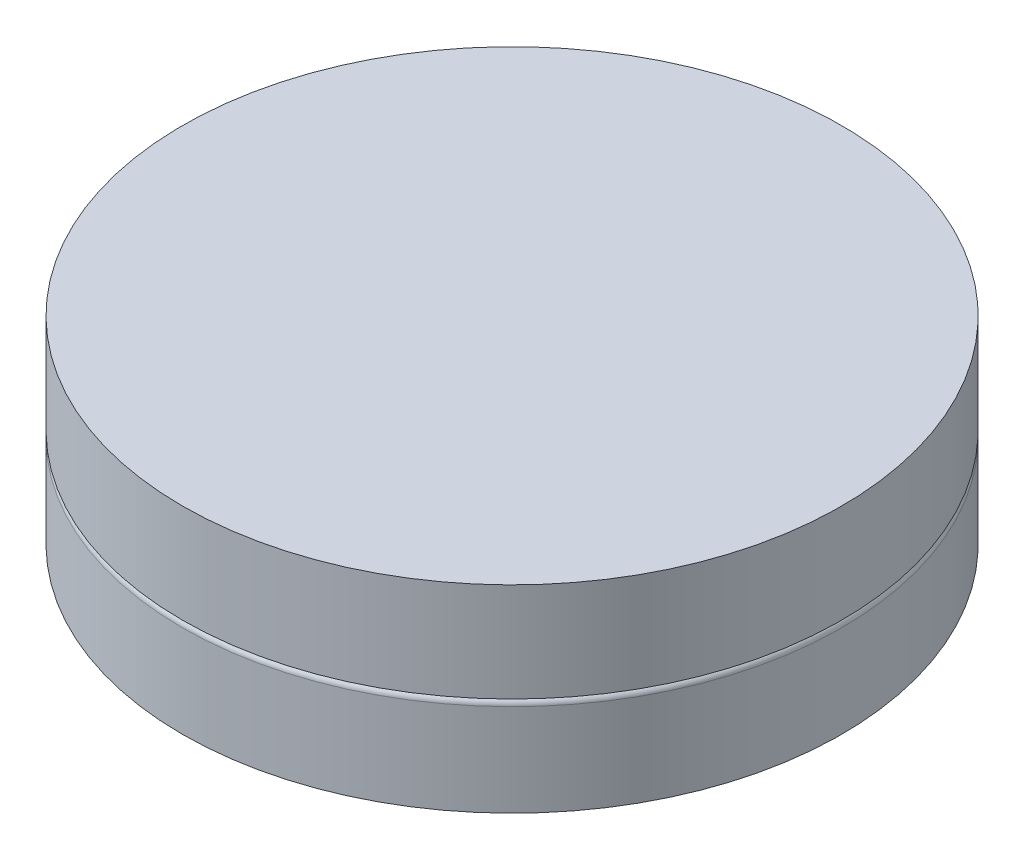
ISO-10303-21;
HEADER;
FILE_DESCRIPTION(('STEP AP214'),'2;1');
FILE_NAME('part.step','',(''),(''),'','','');
FILE_SCHEMA(('AUTOMOTIVE_DESIGN { 1 0 10303 214 1 1 1 1 }'));
ENDSEC;
DATA;
#1=APPLICATION_CONTEXT('core data for automotive mechanical design processes');
#2=APPLICATION_PROTOCOL_DEFINITION('international standard','automotive_design',2000,#1);
#3=PRODUCT_CONTEXT('',#1,'mechanical');
#4=PRODUCT('Part','Part','',(#3));
#5=PRODUCT_RELATED_PRODUCT_CATEGORY('part','',(#4));
#6=PRODUCT_DEFINITION_FORMATION('','',#4);
#7=PRODUCT_DEFINITION_CONTEXT('part definition',#1,'design');
#8=PRODUCT_DEFINITION('design','',#6,#7);
#9=PRODUCT_DEFINITION_SHAPE('','',#8);
#10=(LENGTH_UNIT() NAMED_UNIT(*) SI_UNIT(.MILLI.,.METRE.));
#11=(NAMED_UNIT(*) PLANE_ANGLE_UNIT() SI_UNIT($,.RADIAN.));
#12=(NAMED_UNIT(*) SI_UNIT($,.STERADIAN.) SOLID_ANGLE_UNIT());
#13=UNCERTAINTY_MEASURE_WITH_UNIT(LENGTH_MEASURE(1.E-05),#10,'distance_accuracy_value','');
#14=(GEOMETRIC_REPRESENTATION_CONTEXT(3) GLOBAL_UNCERTAINTY_ASSIGNED_CONTEXT((#13)) GLOBAL_UNIT_ASSIGNED_CONTEXT((#10,
#11,#12)) REPRESENTATION_CONTEXT('',''));
#15=CARTESIAN_POINT('',(0.,0.,0.));
#16=DIRECTION('',(0.,0.,1.));
#17=DIRECTION('',(1.,0.,0.));
#18=AXIS2_PLACEMENT_3D('',#15,#16,#17);
#19=CARTESIAN_POINT('',(0.,0.75,0.));
#20=DIRECTION('',(0.,-1.,0.));
#21=DIRECTION('',(0.,0.,-1.));
#22=AXIS2_PLACEMENT_3D('',#19,#20,#21);
#23=CYLINDRICAL_SURFACE('',#22,2.5);
#24=CARTESIAN_POINT('',(0.,0.7,0.));
#25=DIRECTION('',(0.,1.,0.));
#26=DIRECTION('',(0.,0.,1.));
#27=AXIS2_PLACEMENT_3D('',#24,#25,#26);
#28=CIRCLE('',#27,2.5);
#29=CARTESIAN_POINT('',(0.,0.7,2.5));
#30=VERTEX_POINT('',#29);
#31=EDGE_CURVE('E10',#30,#30,#28,.F.);
#32=ORIENTED_EDGE('',*,*,#31,.T.);
#33=EDGE_LOOP('',(#32));
#34=FACE_BOUND('',#33,.T.);
#35=CARTESIAN_POINT('',(0.,0.,0.));
#36=DIRECTION('',(0.,1.,0.));
#37=DIRECTION('',(0.,0.,1.));
#38=AXIS2_PLACEMENT_3D('',#35,#36,#37);
#39=CIRCLE('',#38,2.5);
#40=CARTESIAN_POINT('',(0.,0.,2.5));
#41=VERTEX_POINT('',#40);
#42=EDGE_CURVE('E41',#41,#41,#39,.T.);
#43=ORIENTED_EDGE('',*,*,#42,.T.);
#44=EDGE_LOOP('',(#43));
#45=FACE_BOUND('',#44,.T.);
#46=ADVANCED_FACE('F30',(#34,#45),#23,.T.);
#47=CARTESIAN_POINT('',(0.,0.,0.));
#48=DIRECTION('',(0.,1.,0.));
#49=DIRECTION('',(0.,0.,1.));
#50=AXIS2_PLACEMENT_3D('',#47,#48,#49);
#51=PLANE('',#50);
#52=ORIENTED_EDGE('',*,*,#42,.F.);
#53=EDGE_LOOP('',(#52));
#54=FACE_BOUND('',#53,.T.);
#55=ADVANCED_FACE('F70',(#54),#51,.F.);
#56=CARTESIAN_POINT('',(0.,0.7,0.));
#57=DIRECTION('',(0.,1.,0.));
#58=DIRECTION('',(0.,0.,1.));
#59=AXIS2_PLACEMENT_3D('',#56,#57,#58);
#60=TOROIDAL_SURFACE('',#59,2.45,0.05);
#61=ORIENTED_EDGE('',*,*,#31,.F.);
#62=EDGE_LOOP('',(#61));
#63=FACE_BOUND('',#62,.T.);
#64=CARTESIAN_POINT('',(0.,0.75,0.));
#65=DIRECTION('',(0.,1.,0.));
#66=DIRECTION('',(0.,0.,1.));
#67=AXIS2_PLACEMENT_3D('',#64,#65,#66);
#68=CIRCLE('',#67,2.45);
#69=CARTESIAN_POINT('',(0.,0.75,2.45));
#70=VERTEX_POINT('',#69);
#71=EDGE_CURVE('E37',#70,#70,#68,.T.);
#72=ORIENTED_EDGE('',*,*,#71,.F.);
#73=EDGE_LOOP('',(#72));
#74=FACE_BOUND('',#73,.T.);
#75=ADVANCED_FACE('F32',(#63,#74),#60,.T.);
#76=CARTESIAN_POINT('',(0.,1.5,0.));
#77=DIRECTION('',(0.,-1.,0.));
#78=DIRECTION('',(0.,0.,-1.));
#79=AXIS2_PLACEMENT_3D('',#76,#77,#78);
#80=CYLINDRICAL_SURFACE('',#79,2.5);
#81=CARTESIAN_POINT('',(0.,1.5,0.));
#82=DIRECTION('',(0.,1.,0.));
#83=DIRECTION('',(0.,0.,1.));
#84=AXIS2_PLACEMENT_3D('',#81,#82,#83);
#85=CIRCLE('',#84,2.5);
#86=CARTESIAN_POINT('',(0.,1.5,2.5));
#87=VERTEX_POINT('',#86);
#88=EDGE_CURVE('E45',#87,#87,#85,.T.);
#89=ORIENTED_EDGE('',*,*,#88,.F.);
#90=EDGE_LOOP('',(#89));
#91=FACE_BOUND('',#90,.T.);
#92=CARTESIAN_POINT('',(0.,0.75,0.));
#93=DIRECTION('',(0.,1.,0.));
#94=DIRECTION('',(0.,0.,1.));
#95=AXIS2_PLACEMENT_3D('',#92,#93,#94);
#96=CIRCLE('',#95,2.5);
#97=CARTESIAN_POINT('',(0.,0.75,2.5));
#98=VERTEX_POINT('',#97);
#99=EDGE_CURVE('E48',#98,#98,#96,.T.);
#100=ORIENTED_EDGE('',*,*,#99,.T.);
#101=EDGE_LOOP('',(#100));
#102=FACE_BOUND('',#101,.T.);
#103=ADVANCED_FACE('F56',(#91,#102),#80,.T.);
#104=CARTESIAN_POINT('',(0.,1.5,0.));
#105=DIRECTION('',(0.,1.,0.));
#106=DIRECTION('',(0.,0.,1.));
#107=AXIS2_PLACEMENT_3D('',#104,#105,#106);
#108=PLANE('',#107);
#109=ORIENTED_EDGE('',*,*,#88,.T.);
#110=EDGE_LOOP('',(#109));
#111=FACE_BOUND('',#110,.T.);
#112=ADVANCED_FACE('F54',(#111),#108,.T.);
#113=CARTESIAN_POINT('',(0.,0.75,0.));
#114=DIRECTION('',(0.,1.,0.));
#115=DIRECTION('',(0.,0.,1.));
#116=AXIS2_PLACEMENT_3D('',#113,#114,#115);
#117=PLANE('',#116);
#118=ORIENTED_EDGE('',*,*,#71,.T.);
#119=EDGE_LOOP('',(#118));
#120=FACE_BOUND('',#119,.T.);
#121=ORIENTED_EDGE('',*,*,#99,.F.);
#122=EDGE_LOOP('',(#121));
#123=FACE_BOUND('',#122,.T.);
#124=ADVANCED_FACE('F62',(#120,#123),#117,.F.);
#125=CLOSED_SHELL('',(#46,#55,#75,#103,#112,#124));
#126=MANIFOLD_SOLID_BREP('B2',#125);
#127=ADVANCED_BREP_SHAPE_REPRESENTATION('',(#18,#126),#14);
#128=SHAPE_DEFINITION_REPRESENTATION(#9,#127);
ENDSEC;
END-ISO-10303-21;
